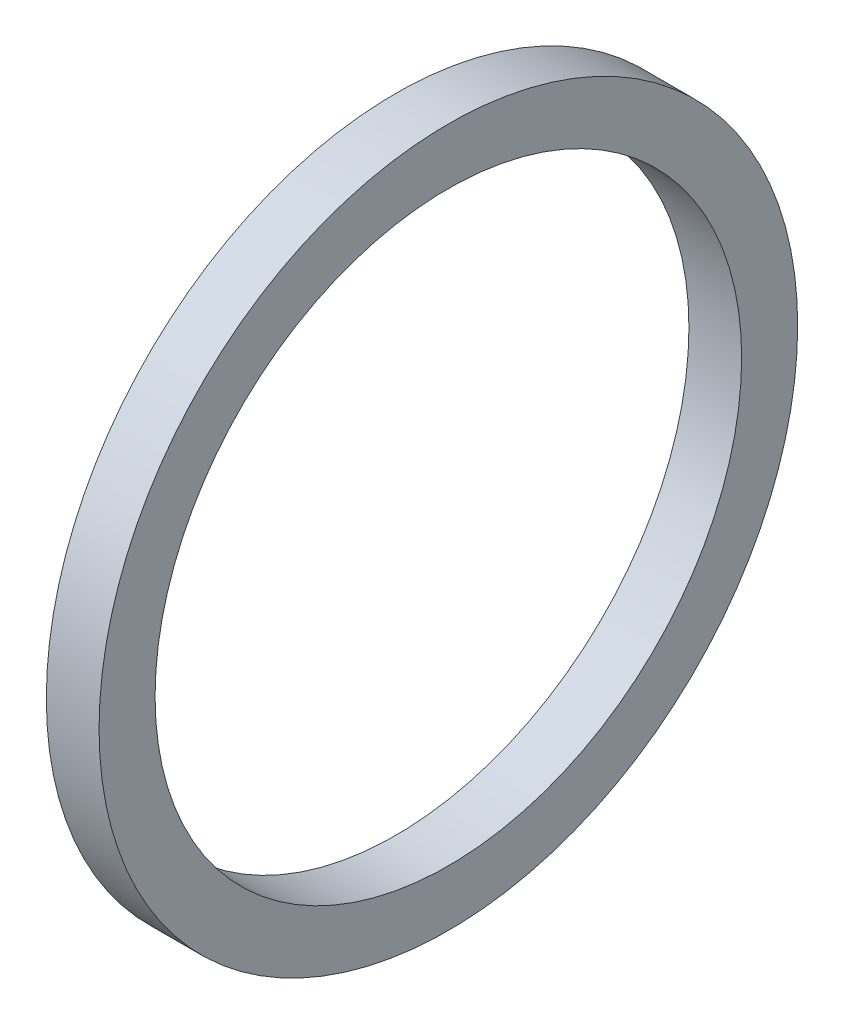
ISO-10303-21;
HEADER;
FILE_DESCRIPTION(('STEP AP214'),'2;1');
FILE_NAME('part.step','',(''),(''),'','','');
FILE_SCHEMA(('AUTOMOTIVE_DESIGN { 1 0 10303 214 1 1 1 1 }'));
ENDSEC;
DATA;
#1=APPLICATION_CONTEXT('core data for automotive mechanical design processes');
#2=APPLICATION_PROTOCOL_DEFINITION('international standard','automotive_design',2000,#1);
#3=PRODUCT_CONTEXT('',#1,'mechanical');
#4=PRODUCT('Part','Part','',(#3));
#5=PRODUCT_RELATED_PRODUCT_CATEGORY('part','',(#4));
#6=PRODUCT_DEFINITION_FORMATION('','',#4);
#7=PRODUCT_DEFINITION_CONTEXT('part definition',#1,'design');
#8=PRODUCT_DEFINITION('design','',#6,#7);
#9=PRODUCT_DEFINITION_SHAPE('','',#8);
#10=(LENGTH_UNIT() NAMED_UNIT(*) SI_UNIT(.MILLI.,.METRE.));
#11=(NAMED_UNIT(*) PLANE_ANGLE_UNIT() SI_UNIT($,.RADIAN.));
#12=(NAMED_UNIT(*) SI_UNIT($,.STERADIAN.) SOLID_ANGLE_UNIT());
#13=UNCERTAINTY_MEASURE_WITH_UNIT(LENGTH_MEASURE(1.E-05),#10,'distance_accuracy_value','');
#14=(GEOMETRIC_REPRESENTATION_CONTEXT(3) GLOBAL_UNCERTAINTY_ASSIGNED_CONTEXT((#13)) GLOBAL_UNIT_ASSIGNED_CONTEXT((#10,
#11,#12)) REPRESENTATION_CONTEXT('',''));
#15=CARTESIAN_POINT('',(0.,0.,0.));
#16=DIRECTION('',(0.,0.,1.));
#17=DIRECTION('',(1.,0.,0.));
#18=AXIS2_PLACEMENT_3D('',#15,#16,#17);
#19=CARTESIAN_POINT('',(0.,-11.303,0.));
#20=DIRECTION('',(-1.,0.,0.));
#21=DIRECTION('',(0.,0.,1.));
#22=AXIS2_PLACEMENT_3D('',#19,#20,#21);
#23=PLANE('',#22);
#24=CARTESIAN_POINT('',(0.,0.,0.));
#25=DIRECTION('',(-1.,0.,0.));
#26=DIRECTION('',(0.,0.,1.));
#27=AXIS2_PLACEMENT_3D('',#24,#25,#26);
#28=CIRCLE('',#27,13.462);
#29=CARTESIAN_POINT('',(0.,0.,13.462));
#30=VERTEX_POINT('',#29);
#31=EDGE_CURVE('E10',#30,#30,#28,.T.);
#32=ORIENTED_EDGE('',*,*,#31,.T.);
#33=EDGE_LOOP('',(#32));
#34=FACE_BOUND('',#33,.T.);
#35=CARTESIAN_POINT('',(0.,0.,0.));
#36=DIRECTION('',(-1.,0.,0.));
#37=DIRECTION('',(0.,0.,1.));
#38=AXIS2_PLACEMENT_3D('',#35,#36,#37);
#39=CIRCLE('',#38,11.303);
#40=CARTESIAN_POINT('',(0.,0.,11.303));
#41=VERTEX_POINT('',#40);
#42=EDGE_CURVE('E43',#41,#41,#39,.T.);
#43=ORIENTED_EDGE('',*,*,#42,.F.);
#44=EDGE_LOOP('',(#43));
#45=FACE_BOUND('',#44,.T.);
#46=ADVANCED_FACE('F29',(#34,#45),#23,.T.);
#47=CARTESIAN_POINT('',(-43.7165807560137,0.,0.));
#48=DIRECTION('',(-1.,0.,0.));
#49=DIRECTION('',(0.,0.,1.));
#50=AXIS2_PLACEMENT_3D('',#47,#48,#49);
#51=CYLINDRICAL_SURFACE('',#50,13.462);
#52=CARTESIAN_POINT('',(2.032,0.,0.));
#53=DIRECTION('',(-1.,0.,0.));
#54=DIRECTION('',(0.,0.,1.));
#55=AXIS2_PLACEMENT_3D('',#52,#53,#54);
#56=CIRCLE('',#55,13.462);
#57=CARTESIAN_POINT('',(2.032,0.,13.462));
#58=VERTEX_POINT('',#57);
#59=EDGE_CURVE('E35',#58,#58,#56,.T.);
#60=ORIENTED_EDGE('',*,*,#59,.T.);
#61=EDGE_LOOP('',(#60));
#62=FACE_BOUND('',#61,.T.);
#63=ORIENTED_EDGE('',*,*,#31,.F.);
#64=EDGE_LOOP('',(#63));
#65=FACE_BOUND('',#64,.T.);
#66=ADVANCED_FACE('F53',(#62,#65),#51,.T.);
#67=CARTESIAN_POINT('',(2.032,-11.303,0.));
#68=DIRECTION('',(1.,0.,0.));
#69=DIRECTION('',(0.,0.,-1.));
#70=AXIS2_PLACEMENT_3D('',#67,#68,#69);
#71=PLANE('',#70);
#72=CARTESIAN_POINT('',(2.032,0.,0.));
#73=DIRECTION('',(-1.,0.,0.));
#74=DIRECTION('',(0.,0.,1.));
#75=AXIS2_PLACEMENT_3D('',#72,#73,#74);
#76=CIRCLE('',#75,11.303);
#77=CARTESIAN_POINT('',(2.032,0.,11.303));
#78=VERTEX_POINT('',#77);
#79=EDGE_CURVE('E39',#78,#78,#76,.T.);
#80=ORIENTED_EDGE('',*,*,#79,.T.);
#81=EDGE_LOOP('',(#80));
#82=FACE_BOUND('',#81,.T.);
#83=ORIENTED_EDGE('',*,*,#59,.F.);
#84=EDGE_LOOP('',(#83));
#85=FACE_BOUND('',#84,.T.);
#86=ADVANCED_FACE('F57',(#82,#85),#71,.T.);
#87=CARTESIAN_POINT('',(-43.7165807560137,0.,0.));
#88=DIRECTION('',(-1.,0.,0.));
#89=DIRECTION('',(0.,0.,1.));
#90=AXIS2_PLACEMENT_3D('',#87,#88,#89);
#91=CYLINDRICAL_SURFACE('',#90,11.303);
#92=ORIENTED_EDGE('',*,*,#42,.T.);
#93=EDGE_LOOP('',(#92));
#94=FACE_BOUND('',#93,.T.);
#95=ORIENTED_EDGE('',*,*,#79,.F.);
#96=EDGE_LOOP('',(#95));
#97=FACE_BOUND('',#96,.T.);
#98=ADVANCED_FACE('F49',(#94,#97),#91,.F.);
#99=CLOSED_SHELL('',(#46,#66,#86,#98));
#100=MANIFOLD_SOLID_BREP('B2',#99);
#101=ADVANCED_BREP_SHAPE_REPRESENTATION('',(#18,#100),#14);
#102=SHAPE_DEFINITION_REPRESENTATION(#9,#101);
ENDSEC;
END-ISO-10303-21;
